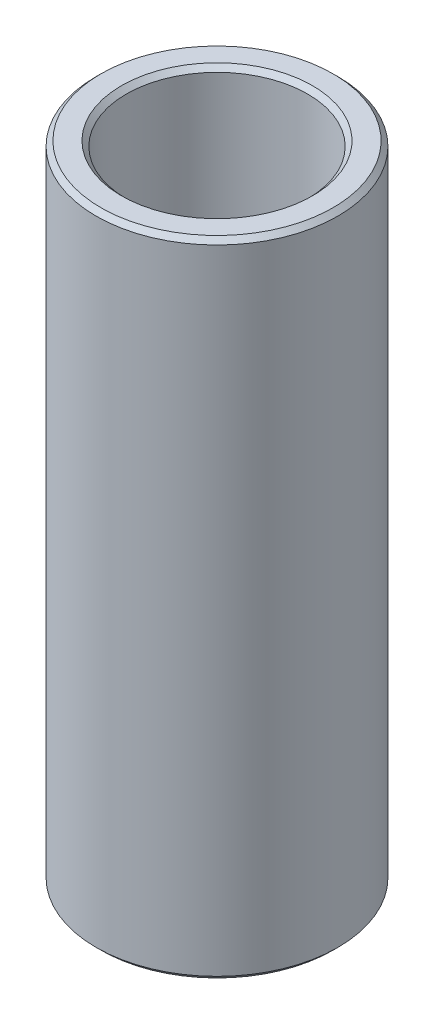
ISO-10303-21;
HEADER;
FILE_DESCRIPTION(('STEP AP214'),'2;1');
FILE_NAME('part.step','',(''),(''),'','','');
FILE_SCHEMA(('AUTOMOTIVE_DESIGN { 1 0 10303 214 1 1 1 1 }'));
ENDSEC;
DATA;
#1=APPLICATION_CONTEXT('core data for automotive mechanical design processes');
#2=APPLICATION_PROTOCOL_DEFINITION('international standard','automotive_design',2000,#1);
#3=PRODUCT_CONTEXT('',#1,'mechanical');
#4=PRODUCT('Part','Part','',(#3));
#5=PRODUCT_RELATED_PRODUCT_CATEGORY('part','',(#4));
#6=PRODUCT_DEFINITION_FORMATION('','',#4);
#7=PRODUCT_DEFINITION_CONTEXT('part definition',#1,'design');
#8=PRODUCT_DEFINITION('design','',#6,#7);
#9=PRODUCT_DEFINITION_SHAPE('','',#8);
#10=(LENGTH_UNIT() NAMED_UNIT(*) SI_UNIT(.MILLI.,.METRE.));
#11=(NAMED_UNIT(*) PLANE_ANGLE_UNIT() SI_UNIT($,.RADIAN.));
#12=(NAMED_UNIT(*) SI_UNIT($,.STERADIAN.) SOLID_ANGLE_UNIT());
#13=UNCERTAINTY_MEASURE_WITH_UNIT(LENGTH_MEASURE(1.E-05),#10,'distance_accuracy_value','');
#14=(GEOMETRIC_REPRESENTATION_CONTEXT(3) GLOBAL_UNCERTAINTY_ASSIGNED_CONTEXT((#13)) GLOBAL_UNIT_ASSIGNED_CONTEXT((#10,
#11,#12)) REPRESENTATION_CONTEXT('',''));
#15=CARTESIAN_POINT('',(0.,0.,0.));
#16=DIRECTION('',(0.,0.,1.));
#17=DIRECTION('',(1.,0.,0.));
#18=AXIS2_PLACEMENT_3D('',#15,#16,#17);
#19=CARTESIAN_POINT('',(6.35000000000028,70.6436949640344,0.));
#20=DIRECTION('',(3.05748469364253E-11,-1.,0.));
#21=DIRECTION('',(1.,3.05748469364253E-11,0.));
#22=AXIS2_PLACEMENT_3D('',#19,#20,#21);
#23=PLANE('',#22);
#24=CARTESIAN_POINT('',(-2.91225417064257E-10,70.6436949638402,0.));
#25=DIRECTION('',(3.05748469364253E-11,-1.,0.));
#26=DIRECTION('',(1.,3.05748469364253E-11,0.));
#27=AXIS2_PLACEMENT_3D('',#24,#25,#26);
#28=CIRCLE('',#27,5.0165000003155);
#29=CARTESIAN_POINT('',(5.01650000002428,70.6436949639936,0.));
#30=VERTEX_POINT('',#29);
#31=EDGE_CURVE('E10',#30,#30,#28,.F.);
#32=ORIENTED_EDGE('',*,*,#31,.T.);
#33=EDGE_LOOP('',(#32));
#34=FACE_BOUND('',#33,.T.);
#35=CARTESIAN_POINT('',(-2.91225417064257E-10,70.6436949638402,0.));
#36=DIRECTION('',(3.05748469364253E-11,-1.,0.));
#37=DIRECTION('',(1.,3.05748469364253E-11,0.));
#38=AXIS2_PLACEMENT_3D('',#35,#36,#37);
#39=CIRCLE('',#38,6.09600000031576);
#40=CARTESIAN_POINT('',(6.09600000002454,70.6436949640266,0.));
#41=VERTEX_POINT('',#40);
#42=EDGE_CURVE('E38',#41,#41,#39,.T.);
#43=ORIENTED_EDGE('',*,*,#42,.T.);
#44=EDGE_LOOP('',(#43));
#45=FACE_BOUND('',#44,.T.);
#46=ADVANCED_FACE('F31',(#34,#45),#23,.T.);
#47=CARTESIAN_POINT('',(0.,61.1186949640101,0.));
#48=DIRECTION('',(3.05748469364253E-11,-1.,0.));
#49=DIRECTION('',(1.,3.05748469364253E-11,0.));
#50=AXIS2_PLACEMENT_3D('',#47,#48,#49);
#51=CYLINDRICAL_SURFACE('',#50,4.76250000080759);
#52=CARTESIAN_POINT('',(-1.31616102801314E-09,104.165877857512,0.));
#53=DIRECTION('',(-3.05748469364255E-11,1.,0.));
#54=DIRECTION('',(-1.,-3.05748469364255E-11,0.));
#55=AXIS2_PLACEMENT_3D('',#52,#53,#54);
#56=CIRCLE('',#55,4.76250000080759);
#57=CARTESIAN_POINT('',(-4.76250000212375,104.165877857367,0.));
#58=VERTEX_POINT('',#57);
#59=EDGE_CURVE('E42',#58,#58,#56,.T.);
#60=ORIENTED_EDGE('',*,*,#59,.T.);
#61=EDGE_LOOP('',(#60));
#62=FACE_BOUND('',#61,.T.);
#63=CARTESIAN_POINT('',(-2.98991428171064E-10,70.8976949633482,0.));
#64=DIRECTION('',(3.05748469364254E-11,-1.,0.));
#65=DIRECTION('',(1.,3.05748469364254E-11,0.));
#66=AXIS2_PLACEMENT_3D('',#63,#64,#65);
#67=CIRCLE('',#66,4.76250000080759);
#68=CARTESIAN_POINT('',(4.7625000005086,70.8976949634938,0.));
#69=VERTEX_POINT('',#68);
#70=EDGE_CURVE('E46',#69,#69,#67,.T.);
#71=ORIENTED_EDGE('',*,*,#70,.T.);
#72=EDGE_LOOP('',(#71));
#73=FACE_BOUND('',#72,.T.);
#74=ADVANCED_FACE('F75',(#62,#73),#51,.F.);
#75=CARTESIAN_POINT('',(4.76250000000001,104.41987785815,0.));
#76=DIRECTION('',(-3.05748469364253E-11,1.,0.));
#77=DIRECTION('',(-1.,-3.05748469364253E-11,0.));
#78=AXIS2_PLACEMENT_3D('',#75,#76,#77);
#79=PLANE('',#78);
#80=CARTESIAN_POINT('',(-1.32392703915003E-09,104.419877858004,0.));
#81=DIRECTION('',(-3.05748469364253E-11,1.,0.));
#82=DIRECTION('',(-1.,-3.05748469364253E-11,0.));
#83=AXIS2_PLACEMENT_3D('',#80,#81,#82);
#84=CIRCLE('',#83,6.09600000129995);
#85=CARTESIAN_POINT('',(-6.09600000262387,104.419877857818,0.));
#86=VERTEX_POINT('',#85);
#87=EDGE_CURVE('E51',#86,#86,#84,.T.);
#88=ORIENTED_EDGE('',*,*,#87,.T.);
#89=EDGE_LOOP('',(#88));
#90=FACE_BOUND('',#89,.T.);
#91=CARTESIAN_POINT('',(-1.32392703915003E-09,104.419877858004,0.));
#92=DIRECTION('',(-3.05748469364253E-11,1.,0.));
#93=DIRECTION('',(-1.,-3.05748469364253E-11,0.));
#94=AXIS2_PLACEMENT_3D('',#91,#92,#93);
#95=CIRCLE('',#94,5.01650000129969);
#96=CARTESIAN_POINT('',(-5.01650000262361,104.419877857851,0.));
#97=VERTEX_POINT('',#96);
#98=EDGE_CURVE('E54',#97,#97,#95,.F.);
#99=ORIENTED_EDGE('',*,*,#98,.T.);
#100=EDGE_LOOP('',(#99));
#101=FACE_BOUND('',#100,.T.);
#102=ADVANCED_FACE('F80',(#90,#101),#79,.T.);
#103=CARTESIAN_POINT('',(0.,61.1186949640101,0.));
#104=DIRECTION('',(3.05748469364253E-11,-1.,0.));
#105=DIRECTION('',(1.,3.05748469364253E-11,0.));
#106=AXIS2_PLACEMENT_3D('',#103,#104,#105);
#107=CYLINDRICAL_SURFACE('',#106,6.35000000080786);
#108=CARTESIAN_POINT('',(-1.31616102804323E-09,104.165877858496,0.));
#109=DIRECTION('',(-3.05748469364252E-11,1.,0.));
#110=DIRECTION('',(-1.,-3.05748469364252E-11,0.));
#111=AXIS2_PLACEMENT_3D('',#108,#109,#110);
#112=CIRCLE('',#111,6.35000000080786);
#113=CARTESIAN_POINT('',(-6.35000000212402,104.165877858302,0.));
#114=VERTEX_POINT('',#113);
#115=EDGE_CURVE('E57',#114,#114,#112,.F.);
#116=ORIENTED_EDGE('',*,*,#115,.T.);
#117=EDGE_LOOP('',(#116));
#118=FACE_BOUND('',#117,.T.);
#119=CARTESIAN_POINT('',(-2.98991428201155E-10,70.8976949643323,0.));
#120=DIRECTION('',(3.05748469364254E-11,-1.,0.));
#121=DIRECTION('',(1.,3.05748469364254E-11,0.));
#122=AXIS2_PLACEMENT_3D('',#119,#120,#121);
#123=CIRCLE('',#122,6.35000000080786);
#124=CARTESIAN_POINT('',(6.35000000050887,70.8976949645265,0.));
#125=VERTEX_POINT('',#124);
#126=EDGE_CURVE('E60',#125,#125,#123,.F.);
#127=ORIENTED_EDGE('',*,*,#126,.T.);
#128=EDGE_LOOP('',(#127));
#129=FACE_BOUND('',#128,.T.);
#130=ADVANCED_FACE('F64',(#118,#129),#107,.T.);
#131=CARTESIAN_POINT('',(-1.31616102804323E-09,104.165877858496,0.));
#132=DIRECTION('',(3.05748469364252E-11,-1.,0.));
#133=DIRECTION('',(1.,3.05748469364252E-11,0.));
#134=AXIS2_PLACEMENT_3D('',#131,#132,#133);
#135=CONICAL_SURFACE('',#134,6.35000000080786,0.785398163397407);
#136=ORIENTED_EDGE('',*,*,#87,.F.);
#137=EDGE_LOOP('',(#136));
#138=FACE_BOUND('',#137,.T.);
#139=ORIENTED_EDGE('',*,*,#115,.F.);
#140=EDGE_LOOP('',(#139));
#141=FACE_BOUND('',#140,.T.);
#142=ADVANCED_FACE('F85',(#138,#141),#135,.T.);
#143=CARTESIAN_POINT('',(-1.32392703915003E-09,104.419877858004,0.));
#144=DIRECTION('',(-3.05748469364255E-11,1.,0.));
#145=DIRECTION('',(-1.,-3.05748469364255E-11,0.));
#146=AXIS2_PLACEMENT_3D('',#143,#144,#145);
#147=CONICAL_SURFACE('',#146,5.01650000129968,0.78539816339746);
#148=ORIENTED_EDGE('',*,*,#59,.F.);
#149=EDGE_LOOP('',(#148));
#150=FACE_BOUND('',#149,.T.);
#151=ORIENTED_EDGE('',*,*,#98,.F.);
#152=EDGE_LOOP('',(#151));
#153=FACE_BOUND('',#152,.T.);
#154=ADVANCED_FACE('F72',(#150,#153),#147,.F.);
#155=CARTESIAN_POINT('',(-2.98991428171064E-10,70.8976949633481,0.));
#156=DIRECTION('',(3.05748469364254E-11,-1.,0.));
#157=DIRECTION('',(1.,3.05748469364254E-11,0.));
#158=AXIS2_PLACEMENT_3D('',#155,#156,#157);
#159=CONICAL_SURFACE('',#158,4.76250000080759,0.785398163397428);
#160=ORIENTED_EDGE('',*,*,#31,.F.);
#161=EDGE_LOOP('',(#160));
#162=FACE_BOUND('',#161,.T.);
#163=ORIENTED_EDGE('',*,*,#70,.F.);
#164=EDGE_LOOP('',(#163));
#165=FACE_BOUND('',#164,.T.);
#166=ADVANCED_FACE('F68',(#162,#165),#159,.F.);
#167=CARTESIAN_POINT('',(-2.91225417064257E-10,70.6436949638402,0.));
#168=DIRECTION('',(-3.05748469364254E-11,1.,0.));
#169=DIRECTION('',(-1.,-3.05748469364254E-11,0.));
#170=AXIS2_PLACEMENT_3D('',#167,#168,#169);
#171=CONICAL_SURFACE('',#170,6.09600000031576,0.785398163397445);
#172=ORIENTED_EDGE('',*,*,#126,.F.);
#173=EDGE_LOOP('',(#172));
#174=FACE_BOUND('',#173,.T.);
#175=ORIENTED_EDGE('',*,*,#42,.F.);
#176=EDGE_LOOP('',(#175));
#177=FACE_BOUND('',#176,.T.);
#178=ADVANCED_FACE('F33',(#174,#177),#171,.T.);
#179=CLOSED_SHELL('',(#46,#74,#102,#130,#142,#154,#166,#178));
#180=MANIFOLD_SOLID_BREP('B2',#179);
#181=ADVANCED_BREP_SHAPE_REPRESENTATION('',(#18,#180),#14);
#182=SHAPE_DEFINITION_REPRESENTATION(#9,#181);
ENDSEC;
END-ISO-10303-21;
